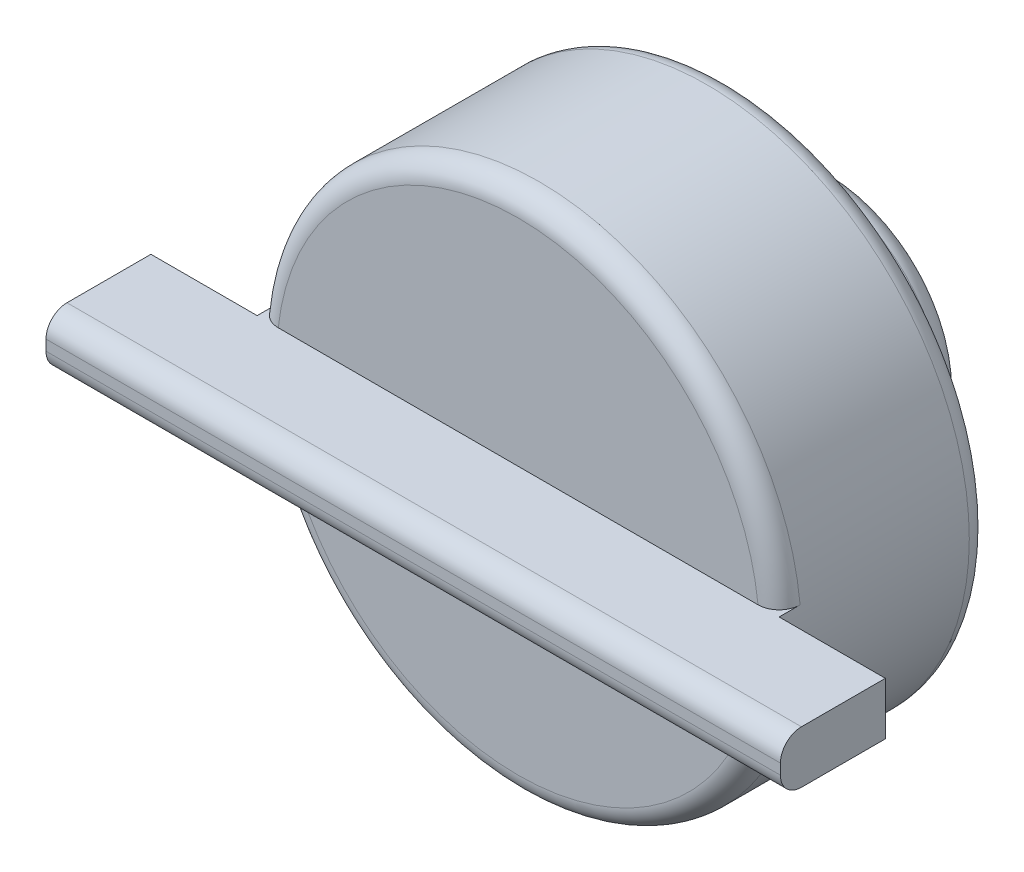
ISO-10303-21;
HEADER;
FILE_DESCRIPTION(('STEP AP214'),'2;1');
FILE_NAME('part.step','',(''),(''),'','','');
FILE_SCHEMA(('AUTOMOTIVE_DESIGN { 1 0 10303 214 1 1 1 1 }'));
ENDSEC;
DATA;
#1=APPLICATION_CONTEXT('core data for automotive mechanical design processes');
#2=APPLICATION_PROTOCOL_DEFINITION('international standard','automotive_design',2000,#1);
#3=PRODUCT_CONTEXT('',#1,'mechanical');
#4=PRODUCT('Part','Part','',(#3));
#5=PRODUCT_RELATED_PRODUCT_CATEGORY('part','',(#4));
#6=PRODUCT_DEFINITION_FORMATION('','',#4);
#7=PRODUCT_DEFINITION_CONTEXT('part definition',#1,'design');
#8=PRODUCT_DEFINITION('design','',#6,#7);
#9=PRODUCT_DEFINITION_SHAPE('','',#8);
#10=(LENGTH_UNIT() NAMED_UNIT(*) SI_UNIT(.MILLI.,.METRE.));
#11=(NAMED_UNIT(*) PLANE_ANGLE_UNIT() SI_UNIT($,.RADIAN.));
#12=(NAMED_UNIT(*) SI_UNIT($,.STERADIAN.) SOLID_ANGLE_UNIT());
#13=UNCERTAINTY_MEASURE_WITH_UNIT(LENGTH_MEASURE(1.E-05),#10,'distance_accuracy_value','');
#14=(GEOMETRIC_REPRESENTATION_CONTEXT(3) GLOBAL_UNCERTAINTY_ASSIGNED_CONTEXT((#13)) GLOBAL_UNIT_ASSIGNED_CONTEXT((#10,
#11,#12)) REPRESENTATION_CONTEXT('',''));
#15=CARTESIAN_POINT('',(0.,0.,0.));
#16=DIRECTION('',(0.,0.,1.));
#17=DIRECTION('',(1.,0.,0.));
#18=AXIS2_PLACEMENT_3D('',#15,#16,#17);
#19=CARTESIAN_POINT('',(0.,0.,30.));
#20=DIRECTION('',(0.,0.,1.));
#21=DIRECTION('',(1.,0.,0.));
#22=AXIS2_PLACEMENT_3D('',#19,#20,#21);
#23=PLANE('',#22);
#24=DIRECTION('',(1.,0.,0.));
#25=VECTOR('',#24,1.);
#26=CARTESIAN_POINT('',(-35.,-2.5,30.));
#27=LINE('',#26,#25);
#28=CARTESIAN_POINT('',(-22.8637267303474,-2.5,30.));
#29=VERTEX_POINT('',#28);
#30=CARTESIAN_POINT('',(22.8637267303474,-2.5,30.));
#31=VERTEX_POINT('',#30);
#32=EDGE_CURVE('E184',#29,#31,#27,.T.);
#33=ORIENTED_EDGE('',*,*,#32,.F.);
#34=CARTESIAN_POINT('',(0.,0.,30.));
#35=DIRECTION('',(0.,0.,1.));
#36=DIRECTION('',(1.,0.,0.));
#37=AXIS2_PLACEMENT_3D('',#34,#35,#36);
#38=CIRCLE('',#37,23.);
#39=EDGE_CURVE('E224',#29,#31,#38,.T.);
#40=ORIENTED_EDGE('',*,*,#39,.T.);
#41=EDGE_LOOP('',(#33,#40));
#42=FACE_BOUND('',#41,.T.);
#43=ADVANCED_FACE('F43',(#42),#23,.T.);
#44=CARTESIAN_POINT('',(0.,0.,0.));
#45=DIRECTION('',(0.,0.,1.));
#46=DIRECTION('',(1.,0.,0.));
#47=AXIS2_PLACEMENT_3D('',#44,#45,#46);
#48=PLANE('',#47);
#49=CARTESIAN_POINT('',(0.,0.,0.));
#50=DIRECTION('',(0.,0.,1.));
#51=DIRECTION('',(1.,0.,0.));
#52=AXIS2_PLACEMENT_3D('',#49,#50,#51);
#53=CIRCLE('',#52,10.5);
#54=CARTESIAN_POINT('',(10.5,0.,0.));
#55=VERTEX_POINT('',#54);
#56=EDGE_CURVE('E274',#55,#55,#53,.F.);
#57=ORIENTED_EDGE('',*,*,#56,.T.);
#58=EDGE_LOOP('',(#57));
#59=FACE_BOUND('',#58,.T.);
#60=CARTESIAN_POINT('',(0.,0.,0.));
#61=DIRECTION('',(0.,0.,1.));
#62=DIRECTION('',(1.,0.,0.));
#63=AXIS2_PLACEMENT_3D('',#60,#61,#62);
#64=CIRCLE('',#63,6.5);
#65=CARTESIAN_POINT('',(6.5,0.,0.));
#66=VERTEX_POINT('',#65);
#67=EDGE_CURVE('E195',#66,#66,#64,.T.);
#68=ORIENTED_EDGE('',*,*,#67,.T.);
#69=EDGE_LOOP('',(#68));
#70=FACE_BOUND('',#69,.T.);
#71=ADVANCED_FACE('F330',(#59,#70),#48,.F.);
#72=CARTESIAN_POINT('',(0.,0.,10.));
#73=DIRECTION('',(0.,0.,-1.));
#74=DIRECTION('',(-1.,0.,0.));
#75=AXIS2_PLACEMENT_3D('',#72,#73,#74);
#76=CYLINDRICAL_SURFACE('',#75,12.5);
#77=CARTESIAN_POINT('',(0.,0.,8.));
#78=DIRECTION('',(0.,0.,1.));
#79=DIRECTION('',(1.,0.,0.));
#80=AXIS2_PLACEMENT_3D('',#77,#78,#79);
#81=CIRCLE('',#80,12.5);
#82=CARTESIAN_POINT('',(12.5,0.,8.));
#83=VERTEX_POINT('',#82);
#84=EDGE_CURVE('E262',#83,#83,#81,.F.);
#85=ORIENTED_EDGE('',*,*,#84,.T.);
#86=EDGE_LOOP('',(#85));
#87=FACE_BOUND('',#86,.T.);
#88=CARTESIAN_POINT('',(0.,0.,2.));
#89=DIRECTION('',(0.,0.,1.));
#90=DIRECTION('',(1.,0.,0.));
#91=AXIS2_PLACEMENT_3D('',#88,#89,#90);
#92=CIRCLE('',#91,12.5);
#93=CARTESIAN_POINT('',(12.5,0.,2.));
#94=VERTEX_POINT('',#93);
#95=EDGE_CURVE('E258',#94,#94,#92,.T.);
#96=ORIENTED_EDGE('',*,*,#95,.T.);
#97=EDGE_LOOP('',(#96));
#98=FACE_BOUND('',#97,.T.);
#99=ADVANCED_FACE('F337',(#87,#98),#76,.T.);
#100=CARTESIAN_POINT('',(0.,0.,10.));
#101=DIRECTION('',(0.,0.,-1.));
#102=DIRECTION('',(-1.,0.,0.));
#103=AXIS2_PLACEMENT_3D('',#100,#101,#102);
#104=CYLINDRICAL_SURFACE('',#103,6.5);
#105=CARTESIAN_POINT('',(0.,0.,8.));
#106=DIRECTION('',(0.,0.,1.));
#107=DIRECTION('',(1.,0.,0.));
#108=AXIS2_PLACEMENT_3D('',#105,#106,#107);
#109=CIRCLE('',#108,6.5);
#110=CARTESIAN_POINT('',(6.5,0.,8.));
#111=VERTEX_POINT('',#110);
#112=EDGE_CURVE('E266',#111,#111,#109,.T.);
#113=ORIENTED_EDGE('',*,*,#112,.T.);
#114=EDGE_LOOP('',(#113));
#115=FACE_BOUND('',#114,.T.);
#116=ORIENTED_EDGE('',*,*,#67,.F.);
#117=EDGE_LOOP('',(#116));
#118=FACE_BOUND('',#117,.T.);
#119=ADVANCED_FACE('F552',(#115,#118),#104,.F.);
#120=CARTESIAN_POINT('',(0.,0.,10.));
#121=DIRECTION('',(0.,0.,1.));
#122=DIRECTION('',(1.,0.,0.));
#123=AXIS2_PLACEMENT_3D('',#120,#121,#122);
#124=PLANE('',#123);
#125=CARTESIAN_POINT('',(0.,0.,10.));
#126=DIRECTION('',(0.,0.,1.));
#127=DIRECTION('',(1.,0.,0.));
#128=AXIS2_PLACEMENT_3D('',#125,#126,#127);
#129=CIRCLE('',#128,4.5);
#130=CARTESIAN_POINT('',(4.5,0.,10.));
#131=VERTEX_POINT('',#130);
#132=EDGE_CURVE('E270',#131,#131,#129,.F.);
#133=ORIENTED_EDGE('',*,*,#132,.T.);
#134=EDGE_LOOP('',(#133));
#135=FACE_BOUND('',#134,.T.);
#136=ADVANCED_FACE('F353',(#135),#124,.F.);
#137=CARTESIAN_POINT('',(0.,0.,30.));
#138=DIRECTION('',(0.,0.,-1.));
#139=DIRECTION('',(-1.,0.,0.));
#140=AXIS2_PLACEMENT_3D('',#137,#138,#139);
#141=CYLINDRICAL_SURFACE('',#140,25.);
#142=CARTESIAN_POINT('',(0.,0.,12.));
#143=DIRECTION('',(0.,0.,1.));
#144=DIRECTION('',(1.,0.,0.));
#145=AXIS2_PLACEMENT_3D('',#142,#143,#144);
#146=CIRCLE('',#145,25.);
#147=CARTESIAN_POINT('',(25.,0.,12.));
#148=VERTEX_POINT('',#147);
#149=EDGE_CURVE('E237',#148,#148,#146,.T.);
#150=ORIENTED_EDGE('',*,*,#149,.T.);
#151=EDGE_LOOP('',(#150));
#152=FACE_BOUND('',#151,.T.);
#153=CARTESIAN_POINT('',(0.,0.,30.));
#154=DIRECTION('',(0.,0.,1.));
#155=DIRECTION('',(1.,0.,0.));
#156=AXIS2_PLACEMENT_3D('',#153,#154,#155);
#157=CIRCLE('',#156,25.);
#158=CARTESIAN_POINT('',(24.8746859276655,-2.5,30.));
#159=VERTEX_POINT('',#158);
#160=CARTESIAN_POINT('',(24.8746859276655,2.5,30.));
#161=VERTEX_POINT('',#160);
#162=EDGE_CURVE('E150',#159,#161,#157,.T.);
#163=ORIENTED_EDGE('',*,*,#162,.F.);
#164=DIRECTION('',(0.,0.,-1.));
#165=VECTOR('',#164,1.);
#166=CARTESIAN_POINT('',(24.8746859276655,-2.5,30.));
#167=LINE('',#166,#165);
#168=CARTESIAN_POINT('',(24.8746859276655,-2.5,28.));
#169=VERTEX_POINT('',#168);
#170=EDGE_CURVE('E73',#159,#169,#167,.T.);
#171=ORIENTED_EDGE('',*,*,#170,.T.);
#172=CARTESIAN_POINT('',(0.,0.,28.));
#173=DIRECTION('',(0.,0.,1.));
#174=DIRECTION('',(1.,0.,0.));
#175=AXIS2_PLACEMENT_3D('',#172,#173,#174);
#176=CIRCLE('',#175,25.);
#177=CARTESIAN_POINT('',(-24.8746859276655,-2.5,28.));
#178=VERTEX_POINT('',#177);
#179=EDGE_CURVE('E244',#169,#178,#176,.F.);
#180=ORIENTED_EDGE('',*,*,#179,.T.);
#181=DIRECTION('',(0.,0.,-1.));
#182=VECTOR('',#181,1.);
#183=CARTESIAN_POINT('',(-24.8746859276655,-2.5,28.));
#184=LINE('',#183,#182);
#185=CARTESIAN_POINT('',(-24.8746859276655,-2.5,30.));
#186=VERTEX_POINT('',#185);
#187=EDGE_CURVE('E241',#178,#186,#184,.F.);
#188=ORIENTED_EDGE('',*,*,#187,.T.);
#189=CARTESIAN_POINT('',(-24.8746859276655,2.5,30.));
#190=VERTEX_POINT('',#189);
#191=EDGE_CURVE('E194',#190,#186,#157,.T.);
#192=ORIENTED_EDGE('',*,*,#191,.F.);
#193=DIRECTION('',(0.,0.,-1.));
#194=VECTOR('',#193,1.);
#195=CARTESIAN_POINT('',(-24.8746859276655,2.5,30.));
#196=LINE('',#195,#194);
#197=CARTESIAN_POINT('',(-24.8746859276655,2.5,28.));
#198=VERTEX_POINT('',#197);
#199=EDGE_CURVE('E65',#190,#198,#196,.T.);
#200=ORIENTED_EDGE('',*,*,#199,.T.);
#201=CARTESIAN_POINT('',(0.,0.,28.));
#202=DIRECTION('',(0.,0.,1.));
#203=DIRECTION('',(1.,0.,0.));
#204=AXIS2_PLACEMENT_3D('',#201,#202,#203);
#205=CIRCLE('',#204,25.);
#206=CARTESIAN_POINT('',(24.8746859276655,2.5,28.));
#207=VERTEX_POINT('',#206);
#208=EDGE_CURVE('E231',#198,#207,#205,.F.);
#209=ORIENTED_EDGE('',*,*,#208,.T.);
#210=DIRECTION('',(0.,0.,-1.));
#211=VECTOR('',#210,1.);
#212=CARTESIAN_POINT('',(24.8746859276655,2.5,28.));
#213=LINE('',#212,#211);
#214=EDGE_CURVE('E228',#207,#161,#213,.F.);
#215=ORIENTED_EDGE('',*,*,#214,.T.);
#216=EDGE_LOOP('',(#163,#171,#180,#188,#192,#200,#209,#215));
#217=FACE_BOUND('',#216,.T.);
#218=ADVANCED_FACE('F345',(#152,#217),#141,.T.);
#219=DIRECTION('',(-1.,0.,0.));
#220=VECTOR('',#219,1.);
#221=CARTESIAN_POINT('',(-35.,2.5,30.));
#222=LINE('',#221,#220);
#223=CARTESIAN_POINT('',(22.8637267303474,2.5,30.));
#224=VERTEX_POINT('',#223);
#225=CARTESIAN_POINT('',(-22.8637267303474,2.5,30.));
#226=VERTEX_POINT('',#225);
#227=EDGE_CURVE('E163',#224,#226,#222,.T.);
#228=ORIENTED_EDGE('',*,*,#227,.F.);
#229=CARTESIAN_POINT('',(0.,0.,30.));
#230=DIRECTION('',(0.,0.,1.));
#231=DIRECTION('',(1.,0.,0.));
#232=AXIS2_PLACEMENT_3D('',#229,#230,#231);
#233=CIRCLE('',#232,23.);
#234=EDGE_CURVE('E278',#224,#226,#233,.T.);
#235=ORIENTED_EDGE('',*,*,#234,.T.);
#236=EDGE_LOOP('',(#228,#235));
#237=FACE_BOUND('',#236,.T.);
#238=ADVANCED_FACE('F333',(#237),#23,.T.);
#239=CARTESIAN_POINT('',(0.,0.,10.));
#240=DIRECTION('',(0.,0.,1.));
#241=DIRECTION('',(1.,0.,0.));
#242=AXIS2_PLACEMENT_3D('',#239,#240,#241);
#243=CIRCLE('',#242,14.5);
#244=CARTESIAN_POINT('',(14.5,0.,10.));
#245=VERTEX_POINT('',#244);
#246=EDGE_CURVE('E254',#245,#245,#243,.T.);
#247=ORIENTED_EDGE('',*,*,#246,.T.);
#248=EDGE_LOOP('',(#247));
#249=FACE_BOUND('',#248,.T.);
#250=CARTESIAN_POINT('',(0.,0.,10.));
#251=DIRECTION('',(0.,0.,1.));
#252=DIRECTION('',(1.,0.,0.));
#253=AXIS2_PLACEMENT_3D('',#250,#251,#252);
#254=CIRCLE('',#253,23.);
#255=CARTESIAN_POINT('',(23.,0.,10.));
#256=VERTEX_POINT('',#255);
#257=EDGE_CURVE('E250',#256,#256,#254,.F.);
#258=ORIENTED_EDGE('',*,*,#257,.T.);
#259=EDGE_LOOP('',(#258));
#260=FACE_BOUND('',#259,.T.);
#261=ADVANCED_FACE('F344',(#249,#260),#124,.F.);
#262=CARTESIAN_POINT('',(0.,0.,30.));
#263=DIRECTION('',(0.,0.,1.));
#264=DIRECTION('',(1.,0.,0.));
#265=AXIS2_PLACEMENT_3D('',#262,#263,#264);
#266=PLANE('',#265);
#267=CARTESIAN_POINT('',(-35.,2.5,30.));
#268=VERTEX_POINT('',#267);
#269=EDGE_CURVE('E161',#190,#268,#222,.T.);
#270=ORIENTED_EDGE('',*,*,#269,.F.);
#271=ORIENTED_EDGE('',*,*,#191,.T.);
#272=CARTESIAN_POINT('',(-35.,-2.5,30.));
#273=VERTEX_POINT('',#272);
#274=EDGE_CURVE('E179',#273,#186,#27,.T.);
#275=ORIENTED_EDGE('',*,*,#274,.F.);
#276=DIRECTION('',(0.,-1.,0.));
#277=VECTOR('',#276,1.);
#278=CARTESIAN_POINT('',(-35.,2.5,30.));
#279=LINE('',#278,#277);
#280=EDGE_CURVE('E160',#268,#273,#279,.T.);
#281=ORIENTED_EDGE('',*,*,#280,.F.);
#282=EDGE_LOOP('',(#270,#271,#275,#281));
#283=FACE_BOUND('',#282,.T.);
#284=ADVANCED_FACE('F351',(#283),#266,.F.);
#285=CARTESIAN_POINT('',(35.,-2.5,30.));
#286=VERTEX_POINT('',#285);
#287=EDGE_CURVE('E178',#159,#286,#27,.T.);
#288=ORIENTED_EDGE('',*,*,#287,.F.);
#289=ORIENTED_EDGE('',*,*,#162,.T.);
#290=CARTESIAN_POINT('',(35.,2.5,30.));
#291=VERTEX_POINT('',#290);
#292=EDGE_CURVE('E143',#291,#161,#222,.T.);
#293=ORIENTED_EDGE('',*,*,#292,.F.);
#294=DIRECTION('',(0.,1.,0.));
#295=VECTOR('',#294,1.);
#296=CARTESIAN_POINT('',(35.,2.5,30.));
#297=LINE('',#296,#295);
#298=EDGE_CURVE('E158',#286,#291,#297,.T.);
#299=ORIENTED_EDGE('',*,*,#298,.F.);
#300=EDGE_LOOP('',(#288,#289,#293,#299));
#301=FACE_BOUND('',#300,.T.);
#302=ADVANCED_FACE('F157',(#301),#266,.F.);
#303=CARTESIAN_POINT('',(35.,2.5,40.));
#304=DIRECTION('',(-1.,0.,0.));
#305=DIRECTION('',(0.,0.,1.));
#306=AXIS2_PLACEMENT_3D('',#303,#304,#305);
#307=PLANE('',#306);
#308=DIRECTION('',(0.,1.,0.));
#309=VECTOR('',#308,1.);
#310=CARTESIAN_POINT('',(35.,2.5,40.));
#311=LINE('',#310,#309);
#312=CARTESIAN_POINT('',(35.,-0.500000000000001,40.));
#313=VERTEX_POINT('',#312);
#314=CARTESIAN_POINT('',(35.,0.499999999999999,40.));
#315=VERTEX_POINT('',#314);
#316=EDGE_CURVE('E183',#313,#315,#311,.T.);
#317=ORIENTED_EDGE('',*,*,#316,.F.);
#318=CARTESIAN_POINT('',(35.,-0.500000000000001,38.));
#319=DIRECTION('',(-1.,0.,0.));
#320=DIRECTION('',(0.,0.,1.));
#321=AXIS2_PLACEMENT_3D('',#318,#319,#320);
#322=CIRCLE('',#321,2.);
#323=CARTESIAN_POINT('',(35.,-2.5,38.));
#324=VERTEX_POINT('',#323);
#325=EDGE_CURVE('E210',#313,#324,#322,.F.);
#326=ORIENTED_EDGE('',*,*,#325,.T.);
#327=DIRECTION('',(0.,0.,-1.));
#328=VECTOR('',#327,1.);
#329=CARTESIAN_POINT('',(35.,-2.5,40.));
#330=LINE('',#329,#328);
#331=EDGE_CURVE('E167',#324,#286,#330,.T.);
#332=ORIENTED_EDGE('',*,*,#331,.T.);
#333=ORIENTED_EDGE('',*,*,#298,.T.);
#334=DIRECTION('',(0.,0.,-1.));
#335=VECTOR('',#334,1.);
#336=CARTESIAN_POINT('',(35.,2.5,40.));
#337=LINE('',#336,#335);
#338=CARTESIAN_POINT('',(35.,2.5,38.));
#339=VERTEX_POINT('',#338);
#340=EDGE_CURVE('E139',#339,#291,#337,.T.);
#341=ORIENTED_EDGE('',*,*,#340,.F.);
#342=CARTESIAN_POINT('',(35.,0.499999999999999,38.));
#343=DIRECTION('',(-1.,0.,0.));
#344=DIRECTION('',(0.,0.,1.));
#345=AXIS2_PLACEMENT_3D('',#342,#343,#344);
#346=CIRCLE('',#345,2.);
#347=EDGE_CURVE('E207',#339,#315,#346,.F.);
#348=ORIENTED_EDGE('',*,*,#347,.T.);
#349=EDGE_LOOP('',(#317,#326,#332,#333,#341,#348));
#350=FACE_BOUND('',#349,.T.);
#351=ADVANCED_FACE('F165',(#350),#307,.F.);
#352=CARTESIAN_POINT('',(-35.,2.5,40.));
#353=DIRECTION('',(0.,-1.,0.));
#354=DIRECTION('',(0.,0.,-1.));
#355=AXIS2_PLACEMENT_3D('',#352,#353,#354);
#356=PLANE('',#355);
#357=DIRECTION('',(0.,0.,-1.));
#358=VECTOR('',#357,1.);
#359=CARTESIAN_POINT('',(-35.,2.5,40.));
#360=LINE('',#359,#358);
#361=CARTESIAN_POINT('',(-35.,2.5,38.));
#362=VERTEX_POINT('',#361);
#363=EDGE_CURVE('E151',#362,#268,#360,.T.);
#364=ORIENTED_EDGE('',*,*,#363,.F.);
#365=DIRECTION('',(-1.,0.,0.));
#366=VECTOR('',#365,1.);
#367=CARTESIAN_POINT('',(35.,2.5,38.));
#368=LINE('',#367,#366);
#369=EDGE_CURVE('E145',#362,#339,#368,.F.);
#370=ORIENTED_EDGE('',*,*,#369,.T.);
#371=ORIENTED_EDGE('',*,*,#340,.T.);
#372=ORIENTED_EDGE('',*,*,#292,.T.);
#373=ORIENTED_EDGE('',*,*,#214,.F.);
#374=CARTESIAN_POINT('',(24.8746859276655,2.5,28.));
#375=CARTESIAN_POINT('',(24.8746856913907,2.5,28.0560596042173));
#376=CARTESIAN_POINT('',(24.8723155457643,2.5,28.1120922855542));
#377=CARTESIAN_POINT('',(24.8628610051777,2.5,28.2237552149999));
#378=CARTESIAN_POINT('',(24.855776880133,2.5,28.2793854859658));
#379=CARTESIAN_POINT('',(24.8275250982491,2.5,28.4449624650431));
#380=CARTESIAN_POINT('',(24.7993578226384,2.5,28.5537976948088));
#381=CARTESIAN_POINT('',(24.725160158196,2.5,28.765187608839));
#382=CARTESIAN_POINT('',(24.6791220075418,2.5,28.8677395416518));
#383=CARTESIAN_POINT('',(24.5705209244519,2.5,29.0636805561674));
#384=CARTESIAN_POINT('',(24.507960283845,2.5,29.157070906208));
#385=CARTESIAN_POINT('',(24.3679669541587,2.5,29.3322600915936));
#386=CARTESIAN_POINT('',(24.2905034220861,2.5,29.4140342651108));
#387=CARTESIAN_POINT('',(24.1229884209676,2.5,29.5635086253887));
#388=CARTESIAN_POINT('',(24.0329344191512,2.5,29.6312059735428));
#389=CARTESIAN_POINT('',(23.8423423293324,2.5,29.7509443401858));
#390=CARTESIAN_POINT('',(23.7417542926852,2.5,29.8029057601663));
#391=CARTESIAN_POINT('',(23.5333299141558,2.5,29.8892780674632));
#392=CARTESIAN_POINT('',(23.4254972265483,2.5,29.9236977289018));
#393=CARTESIAN_POINT('',(23.2415117142385,2.5,29.9658755691837));
#394=CARTESIAN_POINT('',(23.1664726388601,2.5,29.9786653600455));
#395=CARTESIAN_POINT('',(23.0155411452514,2.5,29.9957267161828));
#396=CARTESIAN_POINT('',(22.9396501007027,2.5,30.0000104360026));
#397=CARTESIAN_POINT('',(22.8637267303474,2.5,30.));
#398=B_SPLINE_CURVE_WITH_KNOTS('',3,(#374,#375,#376,#377,#378,#379,#380,#381,#382,#383,#384,
#385,#386,#387,#388,#389,#390,#391,#392,#393,#394,#395,#396,#397),.UNSPECIFIED.,.F.,.F.,(4,2,2,
2,2,2,2,2,2,2,2,4),(0.,0.168075284590855,0.336140946258611,0.671672946817424,1.00735084168907,
1.34298219922806,1.67931580007072,2.01571715730301,2.35379278525458,2.69169914652091,
2.91961133373362,3.14719761630859),.UNSPECIFIED.);
#399=EDGE_CURVE('E11',#207,#224,#398,.T.);
#400=ORIENTED_EDGE('',*,*,#399,.T.);
#401=ORIENTED_EDGE('',*,*,#227,.T.);
#402=CARTESIAN_POINT('',(-22.8637267303474,2.5,30.));
#403=CARTESIAN_POINT('',(-22.9205420437798,2.5,29.9999994486941));
#404=CARTESIAN_POINT('',(-22.9773303170253,2.5,29.9976061255707));
#405=CARTESIAN_POINT('',(-23.090502921444,2.5,29.9880557327069));
#406=CARTESIAN_POINT('',(-23.1468872655345,2.5,29.9808988159958));
#407=CARTESIAN_POINT('',(-23.3147504989019,2.5,29.9523431438418));
#408=CARTESIAN_POINT('',(-23.4251086314202,2.5,29.9238593165926));
#409=CARTESIAN_POINT('',(-23.63947832466,2.5,29.8487531242277));
#410=CARTESIAN_POINT('',(-23.7434863108537,2.5,29.8021206500932));
#411=CARTESIAN_POINT('',(-23.9421568777131,2.5,29.6920111751542));
#412=CARTESIAN_POINT('',(-24.036821623457,2.5,29.6285380894018));
#413=CARTESIAN_POINT('',(-24.2138059155942,2.5,29.4867340156834));
#414=CARTESIAN_POINT('',(-24.2961616897228,2.5,29.4084482297719));
#415=CARTESIAN_POINT('',(-24.4464954022513,2.5,29.2390767064792));
#416=CARTESIAN_POINT('',(-24.5144706464529,2.5,29.1479885758842));
#417=CARTESIAN_POINT('',(-24.6337238773603,2.5,28.9561175252123));
#418=CARTESIAN_POINT('',(-24.685084084323,2.5,28.8553856433201));
#419=CARTESIAN_POINT('',(-24.7700489967629,2.5,28.6467248162343));
#420=CARTESIAN_POINT('',(-24.8036654073928,2.5,28.5388006686671));
#421=CARTESIAN_POINT('',(-24.8434659545567,2.5,28.3584668174671));
#422=CARTESIAN_POINT('',(-24.8551665435686,2.5,28.287226799599));
#423=CARTESIAN_POINT('',(-24.8707751423999,2.5,28.1440015253961));
#424=CARTESIAN_POINT('',(-24.8746942743199,2.5,28.0720174807537));
#425=CARTESIAN_POINT('',(-24.8746859276655,2.5,28.));
#426=B_SPLINE_CURVE_WITH_KNOTS('',3,(#402,#403,#404,#405,#406,#407,#408,#409,#410,#411,#412,
#413,#414,#415,#416,#417,#418,#419,#420,#421,#422,#423,#424,#425),.UNSPECIFIED.,.F.,.F.,(4,2,2,
2,2,2,2,2,2,2,2,4),(0.,0.170341728069484,0.340677984219041,0.680849804379848,1.02121137623025,
1.36149389112417,1.70075428366354,2.04007818060323,2.37769627666381,2.71509137501131,
2.93128130982539,3.14716201950817),.UNSPECIFIED.);
#427=EDGE_CURVE('E58',#226,#198,#426,.T.);
#428=ORIENTED_EDGE('',*,*,#427,.T.);
#429=ORIENTED_EDGE('',*,*,#199,.F.);
#430=ORIENTED_EDGE('',*,*,#269,.T.);
#431=EDGE_LOOP('',(#364,#370,#371,#372,#373,#400,#401,#428,#429,#430));
#432=FACE_BOUND('',#431,.T.);
#433=ADVANCED_FACE('F142',(#432),#356,.F.);
#434=CARTESIAN_POINT('',(-35.,2.5,40.));
#435=DIRECTION('',(1.,0.,0.));
#436=DIRECTION('',(0.,0.,-1.));
#437=AXIS2_PLACEMENT_3D('',#434,#435,#436);
#438=PLANE('',#437);
#439=DIRECTION('',(0.,0.,-1.));
#440=VECTOR('',#439,1.);
#441=CARTESIAN_POINT('',(-35.,-2.5,40.));
#442=LINE('',#441,#440);
#443=CARTESIAN_POINT('',(-35.,-2.5,38.));
#444=VERTEX_POINT('',#443);
#445=EDGE_CURVE('E187',#444,#273,#442,.T.);
#446=ORIENTED_EDGE('',*,*,#445,.F.);
#447=CARTESIAN_POINT('',(-35.,-0.500000000000001,38.));
#448=DIRECTION('',(1.,0.,0.));
#449=DIRECTION('',(0.,0.,-1.));
#450=AXIS2_PLACEMENT_3D('',#447,#448,#449);
#451=CIRCLE('',#450,2.);
#452=CARTESIAN_POINT('',(-35.,-0.500000000000001,40.));
#453=VERTEX_POINT('',#452);
#454=EDGE_CURVE('E219',#444,#453,#451,.F.);
#455=ORIENTED_EDGE('',*,*,#454,.T.);
#456=DIRECTION('',(0.,-1.,0.));
#457=VECTOR('',#456,1.);
#458=CARTESIAN_POINT('',(-35.,2.5,40.));
#459=LINE('',#458,#457);
#460=CARTESIAN_POINT('',(-35.,0.499999999999999,40.));
#461=VERTEX_POINT('',#460);
#462=EDGE_CURVE('E172',#461,#453,#459,.T.);
#463=ORIENTED_EDGE('',*,*,#462,.F.);
#464=CARTESIAN_POINT('',(-35.,0.499999999999999,38.));
#465=DIRECTION('',(1.,0.,0.));
#466=DIRECTION('',(0.,0.,-1.));
#467=AXIS2_PLACEMENT_3D('',#464,#465,#466);
#468=CIRCLE('',#467,2.);
#469=EDGE_CURVE('E216',#461,#362,#468,.F.);
#470=ORIENTED_EDGE('',*,*,#469,.T.);
#471=ORIENTED_EDGE('',*,*,#363,.T.);
#472=ORIENTED_EDGE('',*,*,#280,.T.);
#473=EDGE_LOOP('',(#446,#455,#463,#470,#471,#472));
#474=FACE_BOUND('',#473,.T.);
#475=ADVANCED_FACE('F370',(#474),#438,.F.);
#476=CARTESIAN_POINT('',(-35.,-2.5,40.));
#477=DIRECTION('',(0.,1.,0.));
#478=DIRECTION('',(0.,0.,1.));
#479=AXIS2_PLACEMENT_3D('',#476,#477,#478);
#480=PLANE('',#479);
#481=ORIENTED_EDGE('',*,*,#331,.F.);
#482=DIRECTION('',(1.,0.,0.));
#483=VECTOR('',#482,1.);
#484=CARTESIAN_POINT('',(-35.,-2.5,38.));
#485=LINE('',#484,#483);
#486=EDGE_CURVE('E213',#324,#444,#485,.F.);
#487=ORIENTED_EDGE('',*,*,#486,.T.);
#488=ORIENTED_EDGE('',*,*,#445,.T.);
#489=ORIENTED_EDGE('',*,*,#274,.T.);
#490=ORIENTED_EDGE('',*,*,#187,.F.);
#491=CARTESIAN_POINT('',(-24.8746859276655,-2.5,28.));
#492=CARTESIAN_POINT('',(-24.8746856913907,-2.5,28.0560596042173));
#493=CARTESIAN_POINT('',(-24.8723155457643,-2.5,28.1120922855542));
#494=CARTESIAN_POINT('',(-24.8628610051777,-2.5,28.2237552149999));
#495=CARTESIAN_POINT('',(-24.855776880133,-2.5,28.2793854859658));
#496=CARTESIAN_POINT('',(-24.8275250982491,-2.5,28.4449624650431));
#497=CARTESIAN_POINT('',(-24.7993578226384,-2.5,28.5537976948088));
#498=CARTESIAN_POINT('',(-24.725160158196,-2.5,28.765187608839));
#499=CARTESIAN_POINT('',(-24.6791220075418,-2.5,28.8677395416518));
#500=CARTESIAN_POINT('',(-24.5705209244519,-2.5,29.0636805561674));
#501=CARTESIAN_POINT('',(-24.507960283845,-2.5,29.157070906208));
#502=CARTESIAN_POINT('',(-24.3679669541587,-2.5,29.3322600915936));
#503=CARTESIAN_POINT('',(-24.2905034220861,-2.5,29.4140342651108));
#504=CARTESIAN_POINT('',(-24.1229884209676,-2.5,29.5635086253887));
#505=CARTESIAN_POINT('',(-24.0329344191512,-2.5,29.6312059735428));
#506=CARTESIAN_POINT('',(-23.8423423293324,-2.5,29.7509443401858));
#507=CARTESIAN_POINT('',(-23.7417542926852,-2.5,29.8029057601663));
#508=CARTESIAN_POINT('',(-23.5333299141558,-2.5,29.8892780674632));
#509=CARTESIAN_POINT('',(-23.4254972265483,-2.5,29.9236977289018));
#510=CARTESIAN_POINT('',(-23.2415117142385,-2.5,29.9658755691837));
#511=CARTESIAN_POINT('',(-23.1664726388601,-2.5,29.9786653600455));
#512=CARTESIAN_POINT('',(-23.0155411452514,-2.5,29.9957267161828));
#513=CARTESIAN_POINT('',(-22.9396501007027,-2.5,30.0000104360026));
#514=CARTESIAN_POINT('',(-22.8637267303474,-2.5,30.));
#515=B_SPLINE_CURVE_WITH_KNOTS('',3,(#491,#492,#493,#494,#495,#496,#497,#498,#499,#500,#501,
#502,#503,#504,#505,#506,#507,#508,#509,#510,#511,#512,#513,#514),.UNSPECIFIED.,.F.,.F.,(4,2,2,
2,2,2,2,2,2,2,2,4),(0.,0.168075284590855,0.336140946258611,0.671672946817424,1.00735084168907,
1.34298219922807,1.67931580007072,2.01571715730301,2.35379278525458,2.69169914652091,
2.91961133373362,3.14719761630859),.UNSPECIFIED.);
#516=EDGE_CURVE('E291',#178,#29,#515,.T.);
#517=ORIENTED_EDGE('',*,*,#516,.T.);
#518=ORIENTED_EDGE('',*,*,#32,.T.);
#519=CARTESIAN_POINT('',(22.8637267303474,-2.5,30.));
#520=CARTESIAN_POINT('',(22.9205420437798,-2.5,29.9999994486941));
#521=CARTESIAN_POINT('',(22.9773303170253,-2.5,29.9976061255707));
#522=CARTESIAN_POINT('',(23.090502921444,-2.5,29.9880557327069));
#523=CARTESIAN_POINT('',(23.1468872655345,-2.5,29.9808988159958));
#524=CARTESIAN_POINT('',(23.3147504989019,-2.5,29.9523431438418));
#525=CARTESIAN_POINT('',(23.4251086314202,-2.5,29.9238593165926));
#526=CARTESIAN_POINT('',(23.63947832466,-2.5,29.8487531242277));
#527=CARTESIAN_POINT('',(23.7434863108537,-2.5,29.8021206500932));
#528=CARTESIAN_POINT('',(23.9421568777131,-2.5,29.6920111751542));
#529=CARTESIAN_POINT('',(24.036821623457,-2.5,29.6285380894018));
#530=CARTESIAN_POINT('',(24.2138059155942,-2.5,29.4867340156834));
#531=CARTESIAN_POINT('',(24.2961616897228,-2.5,29.4084482297719));
#532=CARTESIAN_POINT('',(24.4464954022513,-2.5,29.2390767064792));
#533=CARTESIAN_POINT('',(24.5144706464529,-2.5,29.1479885758842));
#534=CARTESIAN_POINT('',(24.6337238773603,-2.5,28.9561175252123));
#535=CARTESIAN_POINT('',(24.685084084323,-2.5,28.8553856433201));
#536=CARTESIAN_POINT('',(24.7700489967629,-2.5,28.6467248162343));
#537=CARTESIAN_POINT('',(24.8036654073928,-2.5,28.5388006686671));
#538=CARTESIAN_POINT('',(24.8434659545567,-2.5,28.3584668174671));
#539=CARTESIAN_POINT('',(24.8551665435686,-2.5,28.287226799599));
#540=CARTESIAN_POINT('',(24.8707751423999,-2.5,28.1440015253961));
#541=CARTESIAN_POINT('',(24.8746942743199,-2.5,28.0720174807537));
#542=CARTESIAN_POINT('',(24.8746859276655,-2.5,28.));
#543=B_SPLINE_CURVE_WITH_KNOTS('',3,(#519,#520,#521,#522,#523,#524,#525,#526,#527,#528,#529,
#530,#531,#532,#533,#534,#535,#536,#537,#538,#539,#540,#541,#542),.UNSPECIFIED.,.F.,.F.,(4,2,2,
2,2,2,2,2,2,2,2,4),(0.,0.170341728069484,0.340677984219041,0.680849804379848,1.02121137623025,
1.36149389112417,1.70075428366354,2.04007818060323,2.37769627666381,2.71509137501131,
2.93128130982539,3.14716201950817),.UNSPECIFIED.);
#544=EDGE_CURVE('E282',#31,#169,#543,.T.);
#545=ORIENTED_EDGE('',*,*,#544,.T.);
#546=ORIENTED_EDGE('',*,*,#170,.F.);
#547=ORIENTED_EDGE('',*,*,#287,.T.);
#548=EDGE_LOOP('',(#481,#487,#488,#489,#490,#517,#518,#545,#546,#547));
#549=FACE_BOUND('',#548,.T.);
#550=ADVANCED_FACE('F296',(#549),#480,.F.);
#551=CARTESIAN_POINT('',(0.,0.,40.));
#552=DIRECTION('',(0.,0.,1.));
#553=DIRECTION('',(1.,0.,0.));
#554=AXIS2_PLACEMENT_3D('',#551,#552,#553);
#555=PLANE('',#554);
#556=ORIENTED_EDGE('',*,*,#462,.T.);
#557=DIRECTION('',(1.,0.,0.));
#558=VECTOR('',#557,1.);
#559=CARTESIAN_POINT('',(35.,-0.500000000000001,40.));
#560=LINE('',#559,#558);
#561=EDGE_CURVE('E203',#453,#313,#560,.T.);
#562=ORIENTED_EDGE('',*,*,#561,.T.);
#563=ORIENTED_EDGE('',*,*,#316,.T.);
#564=DIRECTION('',(-1.,0.,0.));
#565=VECTOR('',#564,1.);
#566=CARTESIAN_POINT('',(-35.,0.499999999999999,40.));
#567=LINE('',#566,#565);
#568=EDGE_CURVE('E199',#315,#461,#567,.T.);
#569=ORIENTED_EDGE('',*,*,#568,.T.);
#570=EDGE_LOOP('',(#556,#562,#563,#569));
#571=FACE_BOUND('',#570,.T.);
#572=ADVANCED_FACE('F381',(#571),#555,.T.);
#573=CARTESIAN_POINT('',(0.,-0.500000000000001,38.));
#574=DIRECTION('',(-1.,0.,0.));
#575=DIRECTION('',(0.,0.,1.));
#576=AXIS2_PLACEMENT_3D('',#573,#574,#575);
#577=CYLINDRICAL_SURFACE('',#576,2.);
#578=ORIENTED_EDGE('',*,*,#454,.F.);
#579=ORIENTED_EDGE('',*,*,#486,.F.);
#580=ORIENTED_EDGE('',*,*,#325,.F.);
#581=ORIENTED_EDGE('',*,*,#561,.F.);
#582=EDGE_LOOP('',(#578,#579,#580,#581));
#583=FACE_BOUND('',#582,.T.);
#584=ADVANCED_FACE('F383',(#583),#577,.T.);
#585=CARTESIAN_POINT('',(0.,0.499999999999999,38.));
#586=DIRECTION('',(1.,0.,0.));
#587=DIRECTION('',(0.,0.,-1.));
#588=AXIS2_PLACEMENT_3D('',#585,#586,#587);
#589=CYLINDRICAL_SURFACE('',#588,2.);
#590=ORIENTED_EDGE('',*,*,#347,.F.);
#591=ORIENTED_EDGE('',*,*,#369,.F.);
#592=ORIENTED_EDGE('',*,*,#469,.F.);
#593=ORIENTED_EDGE('',*,*,#568,.F.);
#594=EDGE_LOOP('',(#590,#591,#592,#593));
#595=FACE_BOUND('',#594,.T.);
#596=ADVANCED_FACE('F306',(#595),#589,.T.);
#597=CARTESIAN_POINT('',(0.,0.,28.));
#598=DIRECTION('',(0.,0.,1.));
#599=DIRECTION('',(1.,0.,0.));
#600=AXIS2_PLACEMENT_3D('',#597,#598,#599);
#601=TOROIDAL_SURFACE('',#600,23.,2.);
#602=ORIENTED_EDGE('',*,*,#516,.F.);
#603=ORIENTED_EDGE('',*,*,#179,.F.);
#604=ORIENTED_EDGE('',*,*,#544,.F.);
#605=ORIENTED_EDGE('',*,*,#39,.F.);
#606=EDGE_LOOP('',(#602,#603,#604,#605));
#607=FACE_BOUND('',#606,.T.);
#608=ADVANCED_FACE('F300',(#607),#601,.T.);
#609=CARTESIAN_POINT('',(0.,0.,8.));
#610=DIRECTION('',(0.,0.,1.));
#611=DIRECTION('',(1.,0.,0.));
#612=AXIS2_PLACEMENT_3D('',#609,#610,#611);
#613=TOROIDAL_SURFACE('',#612,14.5,2.);
#614=ORIENTED_EDGE('',*,*,#84,.F.);
#615=EDGE_LOOP('',(#614));
#616=FACE_BOUND('',#615,.T.);
#617=ORIENTED_EDGE('',*,*,#246,.F.);
#618=EDGE_LOOP('',(#617));
#619=FACE_BOUND('',#618,.T.);
#620=ADVANCED_FACE('F305',(#616,#619),#613,.F.);
#621=CARTESIAN_POINT('',(0.,0.,12.));
#622=DIRECTION('',(0.,0.,1.));
#623=DIRECTION('',(1.,0.,0.));
#624=AXIS2_PLACEMENT_3D('',#621,#622,#623);
#625=TOROIDAL_SURFACE('',#624,23.,2.);
#626=ORIENTED_EDGE('',*,*,#257,.F.);
#627=EDGE_LOOP('',(#626));
#628=FACE_BOUND('',#627,.T.);
#629=ORIENTED_EDGE('',*,*,#149,.F.);
#630=EDGE_LOOP('',(#629));
#631=FACE_BOUND('',#630,.T.);
#632=ADVANCED_FACE('F312',(#628,#631),#625,.T.);
#633=CARTESIAN_POINT('',(0.,0.,8.));
#634=DIRECTION('',(0.,0.,1.));
#635=DIRECTION('',(1.,0.,0.));
#636=AXIS2_PLACEMENT_3D('',#633,#634,#635);
#637=TOROIDAL_SURFACE('',#636,4.5,2.);
#638=ORIENTED_EDGE('',*,*,#132,.F.);
#639=EDGE_LOOP('',(#638));
#640=FACE_BOUND('',#639,.T.);
#641=ORIENTED_EDGE('',*,*,#112,.F.);
#642=EDGE_LOOP('',(#641));
#643=FACE_BOUND('',#642,.T.);
#644=ADVANCED_FACE('F316',(#640,#643),#637,.F.);
#645=CARTESIAN_POINT('',(0.,0.,2.));
#646=DIRECTION('',(0.,0.,1.));
#647=DIRECTION('',(1.,0.,0.));
#648=AXIS2_PLACEMENT_3D('',#645,#646,#647);
#649=TOROIDAL_SURFACE('',#648,10.5,2.);
#650=ORIENTED_EDGE('',*,*,#56,.F.);
#651=EDGE_LOOP('',(#650));
#652=FACE_BOUND('',#651,.T.);
#653=ORIENTED_EDGE('',*,*,#95,.F.);
#654=EDGE_LOOP('',(#653));
#655=FACE_BOUND('',#654,.T.);
#656=ADVANCED_FACE('F319',(#652,#655),#649,.T.);
#657=CARTESIAN_POINT('',(0.,0.,28.));
#658=DIRECTION('',(0.,0.,1.));
#659=DIRECTION('',(1.,0.,0.));
#660=AXIS2_PLACEMENT_3D('',#657,#658,#659);
#661=TOROIDAL_SURFACE('',#660,23.,2.);
#662=ORIENTED_EDGE('',*,*,#399,.F.);
#663=ORIENTED_EDGE('',*,*,#208,.F.);
#664=ORIENTED_EDGE('',*,*,#427,.F.);
#665=ORIENTED_EDGE('',*,*,#234,.F.);
#666=EDGE_LOOP('',(#662,#663,#664,#665));
#667=FACE_BOUND('',#666,.T.);
#668=ADVANCED_FACE('F45',(#667),#661,.T.);
#669=CLOSED_SHELL('',(#43,#71,#99,#119,#136,#218,#238,#261,#284,#302,#351,#433,#475,#550,#572,
#584,#596,#608,#620,#632,#644,#656,#668));
#670=MANIFOLD_SOLID_BREP('B2',#669);
#671=ADVANCED_BREP_SHAPE_REPRESENTATION('',(#18,#670),#14);
#672=SHAPE_DEFINITION_REPRESENTATION(#9,#671);
ENDSEC;
END-ISO-10303-21;
